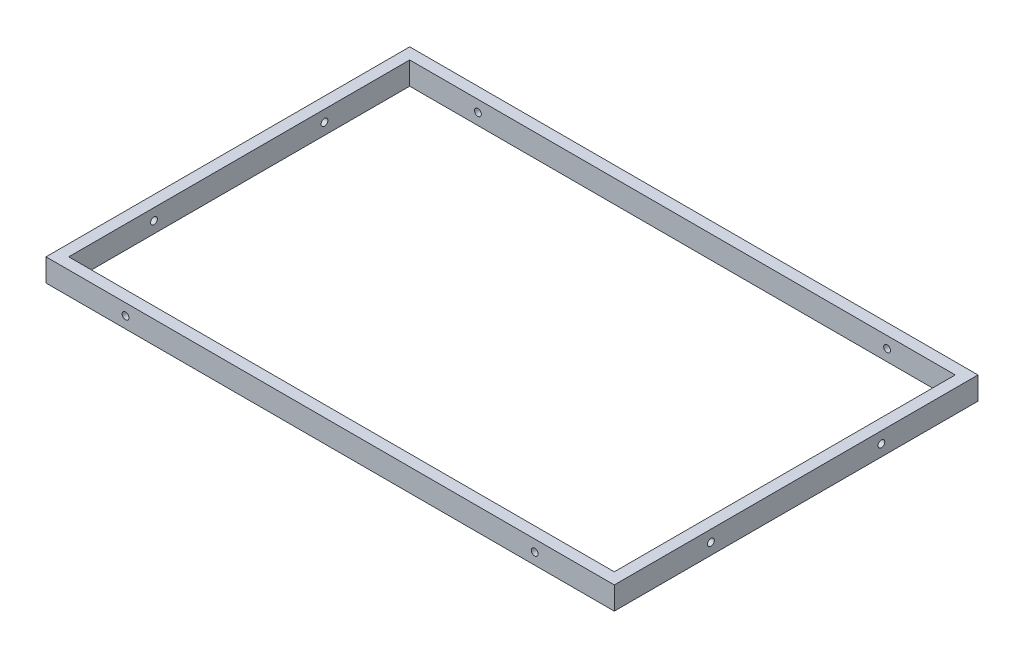
ISO-10303-21;
HEADER;
FILE_DESCRIPTION(('STEP AP214'),'2;1');
FILE_NAME('part.step','',(''),(''),'','','');
FILE_SCHEMA(('AUTOMOTIVE_DESIGN { 1 0 10303 214 1 1 1 1 }'));
ENDSEC;
DATA;
#1=APPLICATION_CONTEXT('core data for automotive mechanical design processes');
#2=APPLICATION_PROTOCOL_DEFINITION('international standard','automotive_design',2000,#1);
#3=PRODUCT_CONTEXT('',#1,'mechanical');
#4=PRODUCT('Part','Part','',(#3));
#5=PRODUCT_RELATED_PRODUCT_CATEGORY('part','',(#4));
#6=PRODUCT_DEFINITION_FORMATION('','',#4);
#7=PRODUCT_DEFINITION_CONTEXT('part definition',#1,'design');
#8=PRODUCT_DEFINITION('design','',#6,#7);
#9=PRODUCT_DEFINITION_SHAPE('','',#8);
#10=(LENGTH_UNIT() NAMED_UNIT(*) SI_UNIT(.MILLI.,.METRE.));
#11=(NAMED_UNIT(*) PLANE_ANGLE_UNIT() SI_UNIT($,.RADIAN.));
#12=(NAMED_UNIT(*) SI_UNIT($,.STERADIAN.) SOLID_ANGLE_UNIT());
#13=UNCERTAINTY_MEASURE_WITH_UNIT(LENGTH_MEASURE(1.E-05),#10,'distance_accuracy_value','');
#14=(GEOMETRIC_REPRESENTATION_CONTEXT(3) GLOBAL_UNCERTAINTY_ASSIGNED_CONTEXT((#13)) GLOBAL_UNIT_ASSIGNED_CONTEXT((#10,
#11,#12)) REPRESENTATION_CONTEXT('',''));
#15=CARTESIAN_POINT('',(0.,0.,0.));
#16=DIRECTION('',(0.,0.,1.));
#17=DIRECTION('',(1.,0.,0.));
#18=AXIS2_PLACEMENT_3D('',#15,#16,#17);
#19=CARTESIAN_POINT('',(0.,20.,0.));
#20=DIRECTION('',(0.,1.,0.));
#21=DIRECTION('',(0.,0.,1.));
#22=AXIS2_PLACEMENT_3D('',#19,#20,#21);
#23=PLANE('',#22);
#24=DIRECTION('',(1.,0.,0.));
#25=VECTOR('',#24,1.);
#26=CARTESIAN_POINT('',(-250.,20.,160.));
#27=LINE('',#26,#25);
#28=CARTESIAN_POINT('',(-250.,20.,160.));
#29=VERTEX_POINT('',#28);
#30=CARTESIAN_POINT('',(250.,20.,160.));
#31=VERTEX_POINT('',#30);
#32=EDGE_CURVE('E138',#29,#31,#27,.T.);
#33=ORIENTED_EDGE('',*,*,#32,.T.);
#34=DIRECTION('',(0.,0.,-1.));
#35=VECTOR('',#34,1.);
#36=CARTESIAN_POINT('',(250.,20.,160.));
#37=LINE('',#36,#35);
#38=CARTESIAN_POINT('',(250.,20.,-160.));
#39=VERTEX_POINT('',#38);
#40=EDGE_CURVE('E141',#31,#39,#37,.T.);
#41=ORIENTED_EDGE('',*,*,#40,.T.);
#42=DIRECTION('',(-1.,0.,0.));
#43=VECTOR('',#42,1.);
#44=CARTESIAN_POINT('',(-250.,20.,-160.));
#45=LINE('',#44,#43);
#46=CARTESIAN_POINT('',(-250.,20.,-160.));
#47=VERTEX_POINT('',#46);
#48=EDGE_CURVE('E144',#39,#47,#45,.T.);
#49=ORIENTED_EDGE('',*,*,#48,.T.);
#50=DIRECTION('',(0.,0.,1.));
#51=VECTOR('',#50,1.);
#52=CARTESIAN_POINT('',(-250.,20.,160.));
#53=LINE('',#52,#51);
#54=EDGE_CURVE('E146',#47,#29,#53,.T.);
#55=ORIENTED_EDGE('',*,*,#54,.T.);
#56=EDGE_LOOP('',(#33,#41,#49,#55));
#57=FACE_BOUND('',#56,.T.);
#58=DIRECTION('',(-1.,0.,0.));
#59=VECTOR('',#58,1.);
#60=CARTESIAN_POINT('',(-240.,20.,-150.));
#61=LINE('',#60,#59);
#62=CARTESIAN_POINT('',(240.,20.,-150.));
#63=VERTEX_POINT('',#62);
#64=CARTESIAN_POINT('',(-240.,20.,-150.));
#65=VERTEX_POINT('',#64);
#66=EDGE_CURVE('E108',#63,#65,#61,.T.);
#67=ORIENTED_EDGE('',*,*,#66,.F.);
#68=DIRECTION('',(0.,0.,-1.));
#69=VECTOR('',#68,1.);
#70=CARTESIAN_POINT('',(240.,20.,150.));
#71=LINE('',#70,#69);
#72=CARTESIAN_POINT('',(240.,20.,150.));
#73=VERTEX_POINT('',#72);
#74=EDGE_CURVE('E100',#73,#63,#71,.T.);
#75=ORIENTED_EDGE('',*,*,#74,.F.);
#76=DIRECTION('',(1.,0.,0.));
#77=VECTOR('',#76,1.);
#78=CARTESIAN_POINT('',(-240.,20.,150.));
#79=LINE('',#78,#77);
#80=CARTESIAN_POINT('',(-240.,20.,150.));
#81=VERTEX_POINT('',#80);
#82=EDGE_CURVE('E122',#81,#73,#79,.T.);
#83=ORIENTED_EDGE('',*,*,#82,.F.);
#84=DIRECTION('',(0.,0.,1.));
#85=VECTOR('',#84,1.);
#86=CARTESIAN_POINT('',(-240.,20.,150.));
#87=LINE('',#86,#85);
#88=EDGE_CURVE('E120',#65,#81,#87,.T.);
#89=ORIENTED_EDGE('',*,*,#88,.F.);
#90=EDGE_LOOP('',(#67,#75,#83,#89));
#91=FACE_BOUND('',#90,.T.);
#92=ADVANCED_FACE('F33',(#57,#91),#23,.T.);
#93=CARTESIAN_POINT('',(0.,0.,0.));
#94=DIRECTION('',(0.,1.,0.));
#95=DIRECTION('',(0.,0.,1.));
#96=AXIS2_PLACEMENT_3D('',#93,#94,#95);
#97=PLANE('',#96);
#98=DIRECTION('',(1.,0.,0.));
#99=VECTOR('',#98,1.);
#100=CARTESIAN_POINT('',(-250.,0.,160.));
#101=LINE('',#100,#99);
#102=CARTESIAN_POINT('',(-250.,0.,160.));
#103=VERTEX_POINT('',#102);
#104=CARTESIAN_POINT('',(250.,0.,160.));
#105=VERTEX_POINT('',#104);
#106=EDGE_CURVE('E116',#103,#105,#101,.T.);
#107=ORIENTED_EDGE('',*,*,#106,.F.);
#108=DIRECTION('',(0.,0.,1.));
#109=VECTOR('',#108,1.);
#110=CARTESIAN_POINT('',(-250.,0.,160.));
#111=LINE('',#110,#109);
#112=CARTESIAN_POINT('',(-250.,0.,-160.));
#113=VERTEX_POINT('',#112);
#114=EDGE_CURVE('E142',#113,#103,#111,.T.);
#115=ORIENTED_EDGE('',*,*,#114,.F.);
#116=DIRECTION('',(-1.,0.,0.));
#117=VECTOR('',#116,1.);
#118=CARTESIAN_POINT('',(-250.,0.,-160.));
#119=LINE('',#118,#117);
#120=CARTESIAN_POINT('',(250.,0.,-160.));
#121=VERTEX_POINT('',#120);
#122=EDGE_CURVE('E153',#121,#113,#119,.T.);
#123=ORIENTED_EDGE('',*,*,#122,.F.);
#124=DIRECTION('',(0.,0.,-1.));
#125=VECTOR('',#124,1.);
#126=CARTESIAN_POINT('',(250.,0.,160.));
#127=LINE('',#126,#125);
#128=EDGE_CURVE('E151',#105,#121,#127,.T.);
#129=ORIENTED_EDGE('',*,*,#128,.F.);
#130=EDGE_LOOP('',(#107,#115,#123,#129));
#131=FACE_BOUND('',#130,.T.);
#132=DIRECTION('',(0.,0.,-1.));
#133=VECTOR('',#132,1.);
#134=CARTESIAN_POINT('',(240.,0.,150.));
#135=LINE('',#134,#133);
#136=CARTESIAN_POINT('',(240.,0.,150.));
#137=VERTEX_POINT('',#136);
#138=CARTESIAN_POINT('',(240.,0.,-150.));
#139=VERTEX_POINT('',#138);
#140=EDGE_CURVE('E58',#137,#139,#135,.T.);
#141=ORIENTED_EDGE('',*,*,#140,.T.);
#142=DIRECTION('',(-1.,0.,0.));
#143=VECTOR('',#142,1.);
#144=CARTESIAN_POINT('',(-240.,0.,-150.));
#145=LINE('',#144,#143);
#146=CARTESIAN_POINT('',(-240.,0.,-150.));
#147=VERTEX_POINT('',#146);
#148=EDGE_CURVE('E115',#139,#147,#145,.T.);
#149=ORIENTED_EDGE('',*,*,#148,.T.);
#150=DIRECTION('',(0.,0.,1.));
#151=VECTOR('',#150,1.);
#152=CARTESIAN_POINT('',(-240.,0.,150.));
#153=LINE('',#152,#151);
#154=CARTESIAN_POINT('',(-240.,0.,150.));
#155=VERTEX_POINT('',#154);
#156=EDGE_CURVE('E130',#147,#155,#153,.T.);
#157=ORIENTED_EDGE('',*,*,#156,.T.);
#158=DIRECTION('',(1.,0.,0.));
#159=VECTOR('',#158,1.);
#160=CARTESIAN_POINT('',(-240.,0.,150.));
#161=LINE('',#160,#159);
#162=EDGE_CURVE('E109',#155,#137,#161,.T.);
#163=ORIENTED_EDGE('',*,*,#162,.T.);
#164=EDGE_LOOP('',(#141,#149,#157,#163));
#165=FACE_BOUND('',#164,.T.);
#166=ADVANCED_FACE('F223',(#131,#165),#97,.F.);
#167=CARTESIAN_POINT('',(-250.,20.,160.));
#168=DIRECTION('',(0.,0.,-1.));
#169=DIRECTION('',(-1.,0.,0.));
#170=AXIS2_PLACEMENT_3D('',#167,#168,#169);
#171=PLANE('',#170);
#172=CARTESIAN_POINT('',(180.,10.,160.));
#173=DIRECTION('',(0.,0.,1.));
#174=DIRECTION('',(-1.,0.,0.));
#175=AXIS2_PLACEMENT_3D('',#172,#173,#174);
#176=CIRCLE('',#175,2.99999999999999);
#177=CARTESIAN_POINT('',(177.,10.,160.));
#178=VERTEX_POINT('',#177);
#179=EDGE_CURVE('E298',#178,#178,#176,.T.);
#180=ORIENTED_EDGE('',*,*,#179,.F.);
#181=EDGE_LOOP('',(#180));
#182=FACE_BOUND('',#181,.T.);
#183=CARTESIAN_POINT('',(-180.,10.,160.));
#184=DIRECTION('',(0.,0.,1.));
#185=DIRECTION('',(1.,0.,0.));
#186=AXIS2_PLACEMENT_3D('',#183,#184,#185);
#187=CIRCLE('',#186,2.99999999999999);
#188=CARTESIAN_POINT('',(-177.,10.,160.));
#189=VERTEX_POINT('',#188);
#190=EDGE_CURVE('E181',#189,#189,#187,.T.);
#191=ORIENTED_EDGE('',*,*,#190,.F.);
#192=EDGE_LOOP('',(#191));
#193=FACE_BOUND('',#192,.T.);
#194=ORIENTED_EDGE('',*,*,#106,.T.);
#195=DIRECTION('',(0.,-1.,0.));
#196=VECTOR('',#195,1.);
#197=CARTESIAN_POINT('',(250.,20.,160.));
#198=LINE('',#197,#196);
#199=EDGE_CURVE('E11',#31,#105,#198,.T.);
#200=ORIENTED_EDGE('',*,*,#199,.F.);
#201=ORIENTED_EDGE('',*,*,#32,.F.);
#202=DIRECTION('',(0.,-1.,0.));
#203=VECTOR('',#202,1.);
#204=CARTESIAN_POINT('',(-250.,20.,160.));
#205=LINE('',#204,#203);
#206=EDGE_CURVE('E148',#29,#103,#205,.T.);
#207=ORIENTED_EDGE('',*,*,#206,.T.);
#208=EDGE_LOOP('',(#194,#200,#201,#207));
#209=FACE_BOUND('',#208,.T.);
#210=ADVANCED_FACE('F35',(#182,#193,#209),#171,.F.);
#211=CARTESIAN_POINT('',(250.,20.,160.));
#212=DIRECTION('',(-1.,0.,0.));
#213=DIRECTION('',(0.,0.,1.));
#214=AXIS2_PLACEMENT_3D('',#211,#212,#213);
#215=PLANE('',#214);
#216=CARTESIAN_POINT('',(250.,10.,75.));
#217=DIRECTION('',(1.,0.,0.));
#218=DIRECTION('',(0.,0.,-1.));
#219=AXIS2_PLACEMENT_3D('',#216,#217,#218);
#220=CIRCLE('',#219,3.00000000000001);
#221=CARTESIAN_POINT('',(250.,10.,72.));
#222=VERTEX_POINT('',#221);
#223=EDGE_CURVE('E178',#222,#222,#220,.T.);
#224=ORIENTED_EDGE('',*,*,#223,.F.);
#225=EDGE_LOOP('',(#224));
#226=FACE_BOUND('',#225,.T.);
#227=CARTESIAN_POINT('',(250.,10.,-75.));
#228=DIRECTION('',(1.,0.,0.));
#229=DIRECTION('',(0.,0.,-1.));
#230=AXIS2_PLACEMENT_3D('',#227,#228,#229);
#231=CIRCLE('',#230,3.00000000000001);
#232=CARTESIAN_POINT('',(250.,10.,-78.));
#233=VERTEX_POINT('',#232);
#234=EDGE_CURVE('E196',#233,#233,#231,.T.);
#235=ORIENTED_EDGE('',*,*,#234,.F.);
#236=EDGE_LOOP('',(#235));
#237=FACE_BOUND('',#236,.T.);
#238=ORIENTED_EDGE('',*,*,#128,.T.);
#239=DIRECTION('',(0.,-1.,0.));
#240=VECTOR('',#239,1.);
#241=CARTESIAN_POINT('',(250.,20.,-160.));
#242=LINE('',#241,#240);
#243=EDGE_CURVE('E42',#39,#121,#242,.T.);
#244=ORIENTED_EDGE('',*,*,#243,.F.);
#245=ORIENTED_EDGE('',*,*,#40,.F.);
#246=ORIENTED_EDGE('',*,*,#199,.T.);
#247=EDGE_LOOP('',(#238,#244,#245,#246));
#248=FACE_BOUND('',#247,.T.);
#249=ADVANCED_FACE('F232',(#226,#237,#248),#215,.F.);
#250=CARTESIAN_POINT('',(-250.,20.,-160.));
#251=DIRECTION('',(0.,0.,1.));
#252=DIRECTION('',(1.,0.,0.));
#253=AXIS2_PLACEMENT_3D('',#250,#251,#252);
#254=PLANE('',#253);
#255=CARTESIAN_POINT('',(180.,10.,-160.));
#256=DIRECTION('',(0.,0.,1.));
#257=DIRECTION('',(1.,0.,0.));
#258=AXIS2_PLACEMENT_3D('',#255,#256,#257);
#259=CIRCLE('',#258,2.99999999999999);
#260=CARTESIAN_POINT('',(183.,10.,-160.));
#261=VERTEX_POINT('',#260);
#262=EDGE_CURVE('E299',#261,#261,#259,.F.);
#263=ORIENTED_EDGE('',*,*,#262,.F.);
#264=EDGE_LOOP('',(#263));
#265=FACE_BOUND('',#264,.T.);
#266=CARTESIAN_POINT('',(-180.,10.,-160.));
#267=DIRECTION('',(0.,0.,1.));
#268=DIRECTION('',(1.,0.,0.));
#269=AXIS2_PLACEMENT_3D('',#266,#267,#268);
#270=CIRCLE('',#269,2.99999999999999);
#271=CARTESIAN_POINT('',(-177.,10.,-160.));
#272=VERTEX_POINT('',#271);
#273=EDGE_CURVE('E174',#272,#272,#270,.F.);
#274=ORIENTED_EDGE('',*,*,#273,.F.);
#275=EDGE_LOOP('',(#274));
#276=FACE_BOUND('',#275,.T.);
#277=ORIENTED_EDGE('',*,*,#122,.T.);
#278=DIRECTION('',(0.,-1.,0.));
#279=VECTOR('',#278,1.);
#280=CARTESIAN_POINT('',(-250.,20.,-160.));
#281=LINE('',#280,#279);
#282=EDGE_CURVE('E158',#47,#113,#281,.T.);
#283=ORIENTED_EDGE('',*,*,#282,.F.);
#284=ORIENTED_EDGE('',*,*,#48,.F.);
#285=ORIENTED_EDGE('',*,*,#243,.T.);
#286=EDGE_LOOP('',(#277,#283,#284,#285));
#287=FACE_BOUND('',#286,.T.);
#288=ADVANCED_FACE('F217',(#265,#276,#287),#254,.F.);
#289=CARTESIAN_POINT('',(-250.,20.,160.));
#290=DIRECTION('',(1.,0.,0.));
#291=DIRECTION('',(0.,0.,-1.));
#292=AXIS2_PLACEMENT_3D('',#289,#290,#291);
#293=PLANE('',#292);
#294=CARTESIAN_POINT('',(-250.,10.,75.));
#295=DIRECTION('',(1.,0.,0.));
#296=DIRECTION('',(0.,0.,-1.));
#297=AXIS2_PLACEMENT_3D('',#294,#295,#296);
#298=CIRCLE('',#297,3.00000000000001);
#299=CARTESIAN_POINT('',(-250.,10.,72.));
#300=VERTEX_POINT('',#299);
#301=EDGE_CURVE('E170',#300,#300,#298,.F.);
#302=ORIENTED_EDGE('',*,*,#301,.F.);
#303=EDGE_LOOP('',(#302));
#304=FACE_BOUND('',#303,.T.);
#305=CARTESIAN_POINT('',(-250.,10.,-75.));
#306=DIRECTION('',(1.,0.,0.));
#307=DIRECTION('',(0.,0.,-1.));
#308=AXIS2_PLACEMENT_3D('',#305,#306,#307);
#309=CIRCLE('',#308,3.00000000000001);
#310=CARTESIAN_POINT('',(-250.,10.,-78.));
#311=VERTEX_POINT('',#310);
#312=EDGE_CURVE('E166',#311,#311,#309,.F.);
#313=ORIENTED_EDGE('',*,*,#312,.F.);
#314=EDGE_LOOP('',(#313));
#315=FACE_BOUND('',#314,.T.);
#316=ORIENTED_EDGE('',*,*,#114,.T.);
#317=ORIENTED_EDGE('',*,*,#206,.F.);
#318=ORIENTED_EDGE('',*,*,#54,.F.);
#319=ORIENTED_EDGE('',*,*,#282,.T.);
#320=EDGE_LOOP('',(#316,#317,#318,#319));
#321=FACE_BOUND('',#320,.T.);
#322=ADVANCED_FACE('F207',(#304,#315,#321),#293,.F.);
#323=CARTESIAN_POINT('',(240.,20.,150.));
#324=DIRECTION('',(-1.,0.,0.));
#325=DIRECTION('',(0.,0.,1.));
#326=AXIS2_PLACEMENT_3D('',#323,#324,#325);
#327=PLANE('',#326);
#328=CARTESIAN_POINT('',(240.,10.,75.));
#329=DIRECTION('',(-1.,0.,0.));
#330=DIRECTION('',(0.,0.,1.));
#331=AXIS2_PLACEMENT_3D('',#328,#329,#330);
#332=CIRCLE('',#331,3.00000000000001);
#333=CARTESIAN_POINT('',(240.,10.,78.));
#334=VERTEX_POINT('',#333);
#335=EDGE_CURVE('E169',#334,#334,#332,.T.);
#336=ORIENTED_EDGE('',*,*,#335,.F.);
#337=EDGE_LOOP('',(#336));
#338=FACE_BOUND('',#337,.T.);
#339=CARTESIAN_POINT('',(240.,10.,-75.));
#340=DIRECTION('',(-1.,0.,0.));
#341=DIRECTION('',(0.,0.,1.));
#342=AXIS2_PLACEMENT_3D('',#339,#340,#341);
#343=CIRCLE('',#342,3.00000000000001);
#344=CARTESIAN_POINT('',(240.,10.,-72.));
#345=VERTEX_POINT('',#344);
#346=EDGE_CURVE('E128',#345,#345,#343,.T.);
#347=ORIENTED_EDGE('',*,*,#346,.F.);
#348=EDGE_LOOP('',(#347));
#349=FACE_BOUND('',#348,.T.);
#350=ORIENTED_EDGE('',*,*,#140,.F.);
#351=DIRECTION('',(0.,-1.,0.));
#352=VECTOR('',#351,1.);
#353=CARTESIAN_POINT('',(240.,20.,150.));
#354=LINE('',#353,#352);
#355=EDGE_CURVE('E104',#73,#137,#354,.T.);
#356=ORIENTED_EDGE('',*,*,#355,.F.);
#357=ORIENTED_EDGE('',*,*,#74,.T.);
#358=DIRECTION('',(0.,-1.,0.));
#359=VECTOR('',#358,1.);
#360=CARTESIAN_POINT('',(240.,20.,-150.));
#361=LINE('',#360,#359);
#362=EDGE_CURVE('E103',#63,#139,#361,.T.);
#363=ORIENTED_EDGE('',*,*,#362,.T.);
#364=EDGE_LOOP('',(#350,#356,#357,#363));
#365=FACE_BOUND('',#364,.T.);
#366=ADVANCED_FACE('F102',(#338,#349,#365),#327,.T.);
#367=CARTESIAN_POINT('',(-240.,20.,-150.));
#368=DIRECTION('',(0.,0.,1.));
#369=DIRECTION('',(1.,0.,0.));
#370=AXIS2_PLACEMENT_3D('',#367,#368,#369);
#371=PLANE('',#370);
#372=CARTESIAN_POINT('',(180.,10.,-150.));
#373=DIRECTION('',(0.,0.,1.));
#374=DIRECTION('',(1.,0.,0.));
#375=AXIS2_PLACEMENT_3D('',#372,#373,#374);
#376=CIRCLE('',#375,2.99999999999999);
#377=CARTESIAN_POINT('',(183.,10.,-150.));
#378=VERTEX_POINT('',#377);
#379=EDGE_CURVE('E186',#378,#378,#376,.T.);
#380=ORIENTED_EDGE('',*,*,#379,.F.);
#381=EDGE_LOOP('',(#380));
#382=FACE_BOUND('',#381,.T.);
#383=CARTESIAN_POINT('',(-180.,10.,-150.));
#384=DIRECTION('',(0.,0.,1.));
#385=DIRECTION('',(1.,0.,0.));
#386=AXIS2_PLACEMENT_3D('',#383,#384,#385);
#387=CIRCLE('',#386,2.99999999999999);
#388=CARTESIAN_POINT('',(-177.,10.,-150.));
#389=VERTEX_POINT('',#388);
#390=EDGE_CURVE('E173',#389,#389,#387,.T.);
#391=ORIENTED_EDGE('',*,*,#390,.F.);
#392=EDGE_LOOP('',(#391));
#393=FACE_BOUND('',#392,.T.);
#394=ORIENTED_EDGE('',*,*,#148,.F.);
#395=ORIENTED_EDGE('',*,*,#362,.F.);
#396=ORIENTED_EDGE('',*,*,#66,.T.);
#397=DIRECTION('',(0.,-1.,0.));
#398=VECTOR('',#397,1.);
#399=CARTESIAN_POINT('',(-240.,20.,-150.));
#400=LINE('',#399,#398);
#401=EDGE_CURVE('E117',#65,#147,#400,.T.);
#402=ORIENTED_EDGE('',*,*,#401,.T.);
#403=EDGE_LOOP('',(#394,#395,#396,#402));
#404=FACE_BOUND('',#403,.T.);
#405=ADVANCED_FACE('F112',(#382,#393,#404),#371,.T.);
#406=CARTESIAN_POINT('',(-240.,20.,150.));
#407=DIRECTION('',(1.,0.,0.));
#408=DIRECTION('',(0.,0.,-1.));
#409=AXIS2_PLACEMENT_3D('',#406,#407,#408);
#410=PLANE('',#409);
#411=CARTESIAN_POINT('',(-240.,10.,75.));
#412=DIRECTION('',(1.,0.,0.));
#413=DIRECTION('',(0.,0.,-1.));
#414=AXIS2_PLACEMENT_3D('',#411,#412,#413);
#415=CIRCLE('',#414,3.00000000000001);
#416=CARTESIAN_POINT('',(-240.,10.,72.));
#417=VERTEX_POINT('',#416);
#418=EDGE_CURVE('E167',#417,#417,#415,.T.);
#419=ORIENTED_EDGE('',*,*,#418,.F.);
#420=EDGE_LOOP('',(#419));
#421=FACE_BOUND('',#420,.T.);
#422=CARTESIAN_POINT('',(-240.,10.,-75.));
#423=DIRECTION('',(1.,0.,0.));
#424=DIRECTION('',(0.,0.,-1.));
#425=AXIS2_PLACEMENT_3D('',#422,#423,#424);
#426=CIRCLE('',#425,3.00000000000001);
#427=CARTESIAN_POINT('',(-240.,10.,-78.));
#428=VERTEX_POINT('',#427);
#429=EDGE_CURVE('E163',#428,#428,#426,.T.);
#430=ORIENTED_EDGE('',*,*,#429,.F.);
#431=EDGE_LOOP('',(#430));
#432=FACE_BOUND('',#431,.T.);
#433=ORIENTED_EDGE('',*,*,#156,.F.);
#434=ORIENTED_EDGE('',*,*,#401,.F.);
#435=ORIENTED_EDGE('',*,*,#88,.T.);
#436=DIRECTION('',(0.,-1.,0.));
#437=VECTOR('',#436,1.);
#438=CARTESIAN_POINT('',(-240.,20.,150.));
#439=LINE('',#438,#437);
#440=EDGE_CURVE('E50',#81,#155,#439,.T.);
#441=ORIENTED_EDGE('',*,*,#440,.T.);
#442=EDGE_LOOP('',(#433,#434,#435,#441));
#443=FACE_BOUND('',#442,.T.);
#444=ADVANCED_FACE('F214',(#421,#432,#443),#410,.T.);
#445=CARTESIAN_POINT('',(-240.,20.,150.));
#446=DIRECTION('',(0.,0.,-1.));
#447=DIRECTION('',(-1.,0.,0.));
#448=AXIS2_PLACEMENT_3D('',#445,#446,#447);
#449=PLANE('',#448);
#450=CARTESIAN_POINT('',(180.,10.,150.));
#451=DIRECTION('',(0.,0.,-1.));
#452=DIRECTION('',(-1.,0.,0.));
#453=AXIS2_PLACEMENT_3D('',#450,#451,#452);
#454=CIRCLE('',#453,2.99999999999999);
#455=CARTESIAN_POINT('',(177.,10.,150.));
#456=VERTEX_POINT('',#455);
#457=EDGE_CURVE('E37',#456,#456,#454,.T.);
#458=ORIENTED_EDGE('',*,*,#457,.F.);
#459=EDGE_LOOP('',(#458));
#460=FACE_BOUND('',#459,.T.);
#461=CARTESIAN_POINT('',(-180.,10.,150.));
#462=DIRECTION('',(0.,0.,-1.));
#463=DIRECTION('',(-1.,0.,0.));
#464=AXIS2_PLACEMENT_3D('',#461,#462,#463);
#465=CIRCLE('',#464,2.99999999999999);
#466=CARTESIAN_POINT('',(-183.,10.,150.));
#467=VERTEX_POINT('',#466);
#468=EDGE_CURVE('E171',#467,#467,#465,.T.);
#469=ORIENTED_EDGE('',*,*,#468,.F.);
#470=EDGE_LOOP('',(#469));
#471=FACE_BOUND('',#470,.T.);
#472=ORIENTED_EDGE('',*,*,#162,.F.);
#473=ORIENTED_EDGE('',*,*,#440,.F.);
#474=ORIENTED_EDGE('',*,*,#82,.T.);
#475=ORIENTED_EDGE('',*,*,#355,.T.);
#476=EDGE_LOOP('',(#472,#473,#474,#475));
#477=FACE_BOUND('',#476,.T.);
#478=ADVANCED_FACE('F259',(#460,#471,#477),#449,.T.);
#479=CARTESIAN_POINT('',(-258.485281374239,10.,-75.));
#480=DIRECTION('',(1.,0.,0.));
#481=DIRECTION('',(0.,0.,-1.));
#482=AXIS2_PLACEMENT_3D('',#479,#480,#481);
#483=CYLINDRICAL_SURFACE('',#482,3.00000000000001);
#484=ORIENTED_EDGE('',*,*,#429,.T.);
#485=EDGE_LOOP('',(#484));
#486=FACE_BOUND('',#485,.T.);
#487=ORIENTED_EDGE('',*,*,#312,.T.);
#488=EDGE_LOOP('',(#487));
#489=FACE_BOUND('',#488,.T.);
#490=ADVANCED_FACE('F261',(#486,#489),#483,.F.);
#491=ORIENTED_EDGE('',*,*,#346,.T.);
#492=EDGE_LOOP('',(#491));
#493=FACE_BOUND('',#492,.T.);
#494=ORIENTED_EDGE('',*,*,#234,.T.);
#495=EDGE_LOOP('',(#494));
#496=FACE_BOUND('',#495,.T.);
#497=ADVANCED_FACE('F203',(#493,#496),#483,.F.);
#498=CARTESIAN_POINT('',(-258.485281374239,10.,75.));
#499=DIRECTION('',(1.,0.,0.));
#500=DIRECTION('',(0.,0.,-1.));
#501=AXIS2_PLACEMENT_3D('',#498,#499,#500);
#502=CYLINDRICAL_SURFACE('',#501,3.00000000000001);
#503=ORIENTED_EDGE('',*,*,#418,.T.);
#504=EDGE_LOOP('',(#503));
#505=FACE_BOUND('',#504,.T.);
#506=ORIENTED_EDGE('',*,*,#301,.T.);
#507=EDGE_LOOP('',(#506));
#508=FACE_BOUND('',#507,.T.);
#509=ADVANCED_FACE('F275',(#505,#508),#502,.F.);
#510=ORIENTED_EDGE('',*,*,#335,.T.);
#511=EDGE_LOOP('',(#510));
#512=FACE_BOUND('',#511,.T.);
#513=ORIENTED_EDGE('',*,*,#223,.T.);
#514=EDGE_LOOP('',(#513));
#515=FACE_BOUND('',#514,.T.);
#516=ADVANCED_FACE('F278',(#512,#515),#502,.F.);
#517=CARTESIAN_POINT('',(-180.,10.,-168.485281374239));
#518=DIRECTION('',(0.,0.,1.));
#519=DIRECTION('',(1.,0.,0.));
#520=AXIS2_PLACEMENT_3D('',#517,#518,#519);
#521=CYLINDRICAL_SURFACE('',#520,2.99999999999999);
#522=ORIENTED_EDGE('',*,*,#468,.T.);
#523=EDGE_LOOP('',(#522));
#524=FACE_BOUND('',#523,.T.);
#525=ORIENTED_EDGE('',*,*,#190,.T.);
#526=EDGE_LOOP('',(#525));
#527=FACE_BOUND('',#526,.T.);
#528=ADVANCED_FACE('F280',(#524,#527),#521,.F.);
#529=ORIENTED_EDGE('',*,*,#390,.T.);
#530=EDGE_LOOP('',(#529));
#531=FACE_BOUND('',#530,.T.);
#532=ORIENTED_EDGE('',*,*,#273,.T.);
#533=EDGE_LOOP('',(#532));
#534=FACE_BOUND('',#533,.T.);
#535=ADVANCED_FACE('F283',(#531,#534),#521,.F.);
#536=CARTESIAN_POINT('',(180.,10.,-168.485281374239));
#537=DIRECTION('',(0.,0.,1.));
#538=DIRECTION('',(1.,0.,0.));
#539=AXIS2_PLACEMENT_3D('',#536,#537,#538);
#540=CYLINDRICAL_SURFACE('',#539,2.99999999999999);
#541=ORIENTED_EDGE('',*,*,#457,.T.);
#542=EDGE_LOOP('',(#541));
#543=FACE_BOUND('',#542,.T.);
#544=ORIENTED_EDGE('',*,*,#179,.T.);
#545=EDGE_LOOP('',(#544));
#546=FACE_BOUND('',#545,.T.);
#547=ADVANCED_FACE('F284',(#543,#546),#540,.F.);
#548=ORIENTED_EDGE('',*,*,#379,.T.);
#549=EDGE_LOOP('',(#548));
#550=FACE_BOUND('',#549,.T.);
#551=ORIENTED_EDGE('',*,*,#262,.T.);
#552=EDGE_LOOP('',(#551));
#553=FACE_BOUND('',#552,.T.);
#554=ADVANCED_FACE('F286',(#550,#553),#540,.F.);
#555=CLOSED_SHELL('',(#92,#166,#210,#249,#288,#322,#366,#405,#444,#478,#490,#497,#509,#516,#528,
#535,#547,#554));
#556=MANIFOLD_SOLID_BREP('B2',#555);
#557=ADVANCED_BREP_SHAPE_REPRESENTATION('',(#18,#556),#14);
#558=SHAPE_DEFINITION_REPRESENTATION(#9,#557);
ENDSEC;
END-ISO-10303-21;
